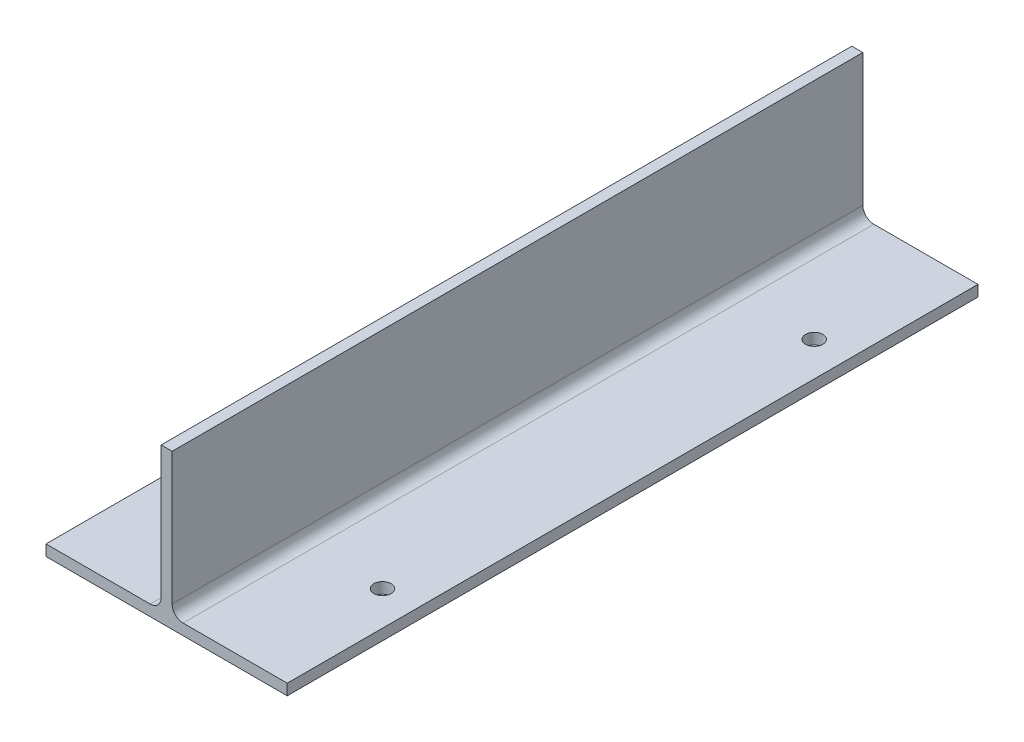
ISO-10303-21;
HEADER;
FILE_DESCRIPTION(('STEP AP214'),'2;1');
FILE_NAME('part.step','',(''),(''),'','','');
FILE_SCHEMA(('AUTOMOTIVE_DESIGN { 1 0 10303 214 1 1 1 1 }'));
ENDSEC;
DATA;
#1=APPLICATION_CONTEXT('core data for automotive mechanical design processes');
#2=APPLICATION_PROTOCOL_DEFINITION('international standard','automotive_design',2000,#1);
#3=PRODUCT_CONTEXT('',#1,'mechanical');
#4=PRODUCT('Part','Part','',(#3));
#5=PRODUCT_RELATED_PRODUCT_CATEGORY('part','',(#4));
#6=PRODUCT_DEFINITION_FORMATION('','',#4);
#7=PRODUCT_DEFINITION_CONTEXT('part definition',#1,'design');
#8=PRODUCT_DEFINITION('design','',#6,#7);
#9=PRODUCT_DEFINITION_SHAPE('','',#8);
#10=(LENGTH_UNIT() NAMED_UNIT(*) SI_UNIT(.MILLI.,.METRE.));
#11=(NAMED_UNIT(*) PLANE_ANGLE_UNIT() SI_UNIT($,.RADIAN.));
#12=(NAMED_UNIT(*) SI_UNIT($,.STERADIAN.) SOLID_ANGLE_UNIT());
#13=UNCERTAINTY_MEASURE_WITH_UNIT(LENGTH_MEASURE(1.E-05),#10,'distance_accuracy_value','');
#14=(GEOMETRIC_REPRESENTATION_CONTEXT(3) GLOBAL_UNCERTAINTY_ASSIGNED_CONTEXT((#13)) GLOBAL_UNIT_ASSIGNED_CONTEXT((#10,
#11,#12)) REPRESENTATION_CONTEXT('',''));
#15=CARTESIAN_POINT('',(0.,0.,0.));
#16=DIRECTION('',(0.,0.,1.));
#17=DIRECTION('',(1.,0.,0.));
#18=AXIS2_PLACEMENT_3D('',#15,#16,#17);
#19=CARTESIAN_POINT('',(3.175,89.3,400.));
#20=DIRECTION('',(0.,-1.,0.));
#21=DIRECTION('',(0.,0.,-1.));
#22=AXIS2_PLACEMENT_3D('',#19,#20,#21);
#23=PLANE('',#22);
#24=DIRECTION('',(-1.,0.,0.));
#25=VECTOR('',#24,1.);
#26=CARTESIAN_POINT('',(3.175,89.3,0.));
#27=LINE('',#26,#25);
#28=CARTESIAN_POINT('',(3.175,89.3,0.));
#29=VERTEX_POINT('',#28);
#30=CARTESIAN_POINT('',(-3.175,89.3,0.));
#31=VERTEX_POINT('',#30);
#32=EDGE_CURVE('E143',#29,#31,#27,.T.);
#33=ORIENTED_EDGE('',*,*,#32,.T.);
#34=DIRECTION('',(0.,0.,-1.));
#35=VECTOR('',#34,1.);
#36=CARTESIAN_POINT('',(-3.175,89.3,400.));
#37=LINE('',#36,#35);
#38=CARTESIAN_POINT('',(-3.175,89.3,400.));
#39=VERTEX_POINT('',#38);
#40=EDGE_CURVE('E11',#39,#31,#37,.T.);
#41=ORIENTED_EDGE('',*,*,#40,.F.);
#42=DIRECTION('',(-1.,0.,0.));
#43=VECTOR('',#42,1.);
#44=CARTESIAN_POINT('',(3.175,89.3,400.));
#45=LINE('',#44,#43);
#46=CARTESIAN_POINT('',(3.175,89.3,400.));
#47=VERTEX_POINT('',#46);
#48=EDGE_CURVE('E162',#47,#39,#45,.T.);
#49=ORIENTED_EDGE('',*,*,#48,.F.);
#50=DIRECTION('',(0.,0.,-1.));
#51=VECTOR('',#50,1.);
#52=CARTESIAN_POINT('',(3.175,89.3,400.));
#53=LINE('',#52,#51);
#54=EDGE_CURVE('E139',#47,#29,#53,.T.);
#55=ORIENTED_EDGE('',*,*,#54,.T.);
#56=EDGE_LOOP('',(#33,#41,#49,#55));
#57=FACE_BOUND('',#56,.T.);
#58=ADVANCED_FACE('F35',(#57),#23,.F.);
#59=CARTESIAN_POINT('',(-3.175,12.7,400.));
#60=DIRECTION('',(1.,0.,0.));
#61=DIRECTION('',(0.,0.,-1.));
#62=AXIS2_PLACEMENT_3D('',#59,#60,#61);
#63=PLANE('',#62);
#64=DIRECTION('',(0.,-1.,0.));
#65=VECTOR('',#64,1.);
#66=CARTESIAN_POINT('',(-3.175,12.7,0.));
#67=LINE('',#66,#65);
#68=CARTESIAN_POINT('',(-3.175,12.7,0.));
#69=VERTEX_POINT('',#68);
#70=EDGE_CURVE('E146',#31,#69,#67,.T.);
#71=ORIENTED_EDGE('',*,*,#70,.T.);
#72=DIRECTION('',(0.,0.,-1.));
#73=VECTOR('',#72,1.);
#74=CARTESIAN_POINT('',(-3.175,12.7,400.));
#75=LINE('',#74,#73);
#76=CARTESIAN_POINT('',(-3.175,12.7,400.));
#77=VERTEX_POINT('',#76);
#78=EDGE_CURVE('E43',#77,#69,#75,.T.);
#79=ORIENTED_EDGE('',*,*,#78,.F.);
#80=DIRECTION('',(0.,-1.,0.));
#81=VECTOR('',#80,1.);
#82=CARTESIAN_POINT('',(-3.175,12.7,400.));
#83=LINE('',#82,#81);
#84=EDGE_CURVE('E100',#39,#77,#83,.T.);
#85=ORIENTED_EDGE('',*,*,#84,.F.);
#86=ORIENTED_EDGE('',*,*,#40,.T.);
#87=EDGE_LOOP('',(#71,#79,#85,#86));
#88=FACE_BOUND('',#87,.T.);
#89=ADVANCED_FACE('F263',(#88),#63,.F.);
#90=CARTESIAN_POINT('',(-9.525,12.7,400.));
#91=DIRECTION('',(0.,0.,-1.));
#92=DIRECTION('',(-1.,0.,0.));
#93=AXIS2_PLACEMENT_3D('',#90,#91,#92);
#94=CYLINDRICAL_SURFACE('',#93,6.35);
#95=CARTESIAN_POINT('',(-9.525,12.7,0.));
#96=DIRECTION('',(0.,0.,-1.));
#97=DIRECTION('',(1.,0.,0.));
#98=AXIS2_PLACEMENT_3D('',#95,#96,#97);
#99=CIRCLE('',#98,6.35);
#100=CARTESIAN_POINT('',(-9.525,6.34999999999999,0.));
#101=VERTEX_POINT('',#100);
#102=EDGE_CURVE('E149',#69,#101,#99,.T.);
#103=ORIENTED_EDGE('',*,*,#102,.T.);
#104=DIRECTION('',(0.,0.,-1.));
#105=VECTOR('',#104,1.);
#106=CARTESIAN_POINT('',(-9.525,6.34999999999999,400.));
#107=LINE('',#106,#105);
#108=CARTESIAN_POINT('',(-9.525,6.34999999999999,400.));
#109=VERTEX_POINT('',#108);
#110=EDGE_CURVE('E175',#109,#101,#107,.T.);
#111=ORIENTED_EDGE('',*,*,#110,.F.);
#112=CARTESIAN_POINT('',(-9.525,12.7,400.));
#113=DIRECTION('',(0.,0.,-1.));
#114=DIRECTION('',(1.,0.,0.));
#115=AXIS2_PLACEMENT_3D('',#112,#113,#114);
#116=CIRCLE('',#115,6.35);
#117=EDGE_CURVE('E183',#77,#109,#116,.T.);
#118=ORIENTED_EDGE('',*,*,#117,.F.);
#119=ORIENTED_EDGE('',*,*,#78,.T.);
#120=EDGE_LOOP('',(#103,#111,#118,#119));
#121=FACE_BOUND('',#120,.T.);
#122=ADVANCED_FACE('F181',(#121),#94,.F.);
#123=CARTESIAN_POINT('',(-69.85,6.35,400.));
#124=DIRECTION('',(0.,-1.,0.));
#125=DIRECTION('',(1.,0.,0.));
#126=AXIS2_PLACEMENT_3D('',#123,#124,#125);
#127=PLANE('',#126);
#128=CARTESIAN_POINT('',(-50.,6.34999999999999,325.));
#129=DIRECTION('',(0.,1.,0.));
#130=DIRECTION('',(1.,0.,0.));
#131=AXIS2_PLACEMENT_3D('',#128,#129,#130);
#132=CIRCLE('',#131,5.00000000000001);
#133=CARTESIAN_POINT('',(-45.,6.34999999999999,325.));
#134=VERTEX_POINT('',#133);
#135=EDGE_CURVE('E227',#134,#134,#132,.T.);
#136=ORIENTED_EDGE('',*,*,#135,.F.);
#137=EDGE_LOOP('',(#136));
#138=FACE_BOUND('',#137,.T.);
#139=CARTESIAN_POINT('',(-50.,6.34999999999999,75.));
#140=DIRECTION('',(0.,1.,0.));
#141=DIRECTION('',(1.,0.,0.));
#142=AXIS2_PLACEMENT_3D('',#139,#140,#141);
#143=CIRCLE('',#142,5.00000000000001);
#144=CARTESIAN_POINT('',(-45.,6.34999999999999,75.));
#145=VERTEX_POINT('',#144);
#146=EDGE_CURVE('E215',#145,#145,#143,.T.);
#147=ORIENTED_EDGE('',*,*,#146,.F.);
#148=EDGE_LOOP('',(#147));
#149=FACE_BOUND('',#148,.T.);
#150=DIRECTION('',(-1.,0.,0.));
#151=VECTOR('',#150,1.);
#152=CARTESIAN_POINT('',(-69.85,6.35,0.));
#153=LINE('',#152,#151);
#154=CARTESIAN_POINT('',(-69.85,6.35,0.));
#155=VERTEX_POINT('',#154);
#156=EDGE_CURVE('E151',#101,#155,#153,.T.);
#157=ORIENTED_EDGE('',*,*,#156,.T.);
#158=DIRECTION('',(0.,0.,-1.));
#159=VECTOR('',#158,1.);
#160=CARTESIAN_POINT('',(-69.85,6.35,400.));
#161=LINE('',#160,#159);
#162=CARTESIAN_POINT('',(-69.85,6.35,400.));
#163=VERTEX_POINT('',#162);
#164=EDGE_CURVE('E172',#163,#155,#161,.T.);
#165=ORIENTED_EDGE('',*,*,#164,.F.);
#166=DIRECTION('',(-1.,0.,0.));
#167=VECTOR('',#166,1.);
#168=CARTESIAN_POINT('',(-69.85,6.35,400.));
#169=LINE('',#168,#167);
#170=EDGE_CURVE('E201',#109,#163,#169,.T.);
#171=ORIENTED_EDGE('',*,*,#170,.F.);
#172=ORIENTED_EDGE('',*,*,#110,.T.);
#173=EDGE_LOOP('',(#157,#165,#171,#172));
#174=FACE_BOUND('',#173,.T.);
#175=ADVANCED_FACE('F192',(#138,#149,#174),#127,.F.);
#176=CARTESIAN_POINT('',(-69.85,0.,400.));
#177=DIRECTION('',(1.,0.,0.));
#178=DIRECTION('',(0.,0.,-1.));
#179=AXIS2_PLACEMENT_3D('',#176,#177,#178);
#180=PLANE('',#179);
#181=DIRECTION('',(0.,-1.,0.));
#182=VECTOR('',#181,1.);
#183=CARTESIAN_POINT('',(-69.85,0.,0.));
#184=LINE('',#183,#182);
#185=CARTESIAN_POINT('',(-69.85,0.,0.));
#186=VERTEX_POINT('',#185);
#187=EDGE_CURVE('E153',#155,#186,#184,.T.);
#188=ORIENTED_EDGE('',*,*,#187,.T.);
#189=DIRECTION('',(0.,0.,-1.));
#190=VECTOR('',#189,1.);
#191=CARTESIAN_POINT('',(-69.85,0.,400.));
#192=LINE('',#191,#190);
#193=CARTESIAN_POINT('',(-69.85,0.,400.));
#194=VERTEX_POINT('',#193);
#195=EDGE_CURVE('E169',#194,#186,#192,.T.);
#196=ORIENTED_EDGE('',*,*,#195,.F.);
#197=DIRECTION('',(0.,-1.,0.));
#198=VECTOR('',#197,1.);
#199=CARTESIAN_POINT('',(-69.85,0.,400.));
#200=LINE('',#199,#198);
#201=EDGE_CURVE('E198',#163,#194,#200,.T.);
#202=ORIENTED_EDGE('',*,*,#201,.F.);
#203=ORIENTED_EDGE('',*,*,#164,.T.);
#204=EDGE_LOOP('',(#188,#196,#202,#203));
#205=FACE_BOUND('',#204,.T.);
#206=ADVANCED_FACE('F196',(#205),#180,.F.);
#207=CARTESIAN_POINT('',(-69.85,0.,400.));
#208=DIRECTION('',(0.,1.,0.));
#209=DIRECTION('',(0.,0.,1.));
#210=AXIS2_PLACEMENT_3D('',#207,#208,#209);
#211=PLANE('',#210);
#212=CARTESIAN_POINT('',(-50.,0.,325.));
#213=DIRECTION('',(0.,1.,0.));
#214=DIRECTION('',(1.,0.,0.));
#215=AXIS2_PLACEMENT_3D('',#212,#213,#214);
#216=CIRCLE('',#215,5.00000000000001);
#217=CARTESIAN_POINT('',(-45.,0.,325.));
#218=VERTEX_POINT('',#217);
#219=EDGE_CURVE('E224',#218,#218,#216,.T.);
#220=ORIENTED_EDGE('',*,*,#219,.T.);
#221=EDGE_LOOP('',(#220));
#222=FACE_BOUND('',#221,.T.);
#223=CARTESIAN_POINT('',(50.,0.,325.));
#224=DIRECTION('',(0.,1.,0.));
#225=DIRECTION('',(-1.,0.,0.));
#226=AXIS2_PLACEMENT_3D('',#223,#224,#225);
#227=CIRCLE('',#226,5.00000000000001);
#228=CARTESIAN_POINT('',(45.,0.,325.));
#229=VERTEX_POINT('',#228);
#230=EDGE_CURVE('E218',#229,#229,#227,.T.);
#231=ORIENTED_EDGE('',*,*,#230,.T.);
#232=EDGE_LOOP('',(#231));
#233=FACE_BOUND('',#232,.T.);
#234=CARTESIAN_POINT('',(-50.,0.,75.));
#235=DIRECTION('',(0.,1.,0.));
#236=DIRECTION('',(1.,0.,0.));
#237=AXIS2_PLACEMENT_3D('',#234,#235,#236);
#238=CIRCLE('',#237,5.00000000000001);
#239=CARTESIAN_POINT('',(-45.,0.,75.));
#240=VERTEX_POINT('',#239);
#241=EDGE_CURVE('E212',#240,#240,#238,.T.);
#242=ORIENTED_EDGE('',*,*,#241,.T.);
#243=EDGE_LOOP('',(#242));
#244=FACE_BOUND('',#243,.T.);
#245=CARTESIAN_POINT('',(50.,0.,75.));
#246=DIRECTION('',(0.,1.,0.));
#247=DIRECTION('',(-1.,0.,0.));
#248=AXIS2_PLACEMENT_3D('',#245,#246,#247);
#249=CIRCLE('',#248,5.00000000000001);
#250=CARTESIAN_POINT('',(45.,0.,75.));
#251=VERTEX_POINT('',#250);
#252=EDGE_CURVE('E147',#251,#251,#249,.T.);
#253=ORIENTED_EDGE('',*,*,#252,.T.);
#254=EDGE_LOOP('',(#253));
#255=FACE_BOUND('',#254,.T.);
#256=DIRECTION('',(1.,0.,0.));
#257=VECTOR('',#256,1.);
#258=CARTESIAN_POINT('',(-69.85,0.,0.));
#259=LINE('',#258,#257);
#260=CARTESIAN_POINT('',(69.85,0.,0.));
#261=VERTEX_POINT('',#260);
#262=EDGE_CURVE('E155',#186,#261,#259,.T.);
#263=ORIENTED_EDGE('',*,*,#262,.T.);
#264=DIRECTION('',(0.,0.,-1.));
#265=VECTOR('',#264,1.);
#266=CARTESIAN_POINT('',(69.85,0.,400.));
#267=LINE('',#266,#265);
#268=CARTESIAN_POINT('',(69.85,0.,400.));
#269=VERTEX_POINT('',#268);
#270=EDGE_CURVE('E166',#269,#261,#267,.T.);
#271=ORIENTED_EDGE('',*,*,#270,.F.);
#272=DIRECTION('',(1.,0.,0.));
#273=VECTOR('',#272,1.);
#274=CARTESIAN_POINT('',(-69.85,0.,400.));
#275=LINE('',#274,#273);
#276=EDGE_CURVE('E200',#194,#269,#275,.T.);
#277=ORIENTED_EDGE('',*,*,#276,.F.);
#278=ORIENTED_EDGE('',*,*,#195,.T.);
#279=EDGE_LOOP('',(#263,#271,#277,#278));
#280=FACE_BOUND('',#279,.T.);
#281=ADVANCED_FACE('F233',(#222,#233,#244,#255,#280),#211,.F.);
#282=CARTESIAN_POINT('',(69.85,0.,400.));
#283=DIRECTION('',(-1.,0.,0.));
#284=DIRECTION('',(0.,0.,1.));
#285=AXIS2_PLACEMENT_3D('',#282,#283,#284);
#286=PLANE('',#285);
#287=DIRECTION('',(0.,1.,0.));
#288=VECTOR('',#287,1.);
#289=CARTESIAN_POINT('',(69.85,0.,0.));
#290=LINE('',#289,#288);
#291=CARTESIAN_POINT('',(69.85,6.35,0.));
#292=VERTEX_POINT('',#291);
#293=EDGE_CURVE('E157',#261,#292,#290,.T.);
#294=ORIENTED_EDGE('',*,*,#293,.T.);
#295=DIRECTION('',(0.,0.,-1.));
#296=VECTOR('',#295,1.);
#297=CARTESIAN_POINT('',(69.85,6.35,400.));
#298=LINE('',#297,#296);
#299=CARTESIAN_POINT('',(69.85,6.35,400.));
#300=VERTEX_POINT('',#299);
#301=EDGE_CURVE('E134',#300,#292,#298,.T.);
#302=ORIENTED_EDGE('',*,*,#301,.F.);
#303=DIRECTION('',(0.,1.,0.));
#304=VECTOR('',#303,1.);
#305=CARTESIAN_POINT('',(69.85,0.,400.));
#306=LINE('',#305,#304);
#307=EDGE_CURVE('E125',#269,#300,#306,.T.);
#308=ORIENTED_EDGE('',*,*,#307,.F.);
#309=ORIENTED_EDGE('',*,*,#270,.T.);
#310=EDGE_LOOP('',(#294,#302,#308,#309));
#311=FACE_BOUND('',#310,.T.);
#312=ADVANCED_FACE('F272',(#311),#286,.F.);
#313=CARTESIAN_POINT('',(69.85,6.35,400.));
#314=DIRECTION('',(0.,-1.,0.));
#315=DIRECTION('',(1.,0.,0.));
#316=AXIS2_PLACEMENT_3D('',#313,#314,#315);
#317=PLANE('',#316);
#318=CARTESIAN_POINT('',(50.,6.34999999999999,325.));
#319=DIRECTION('',(0.,1.,0.));
#320=DIRECTION('',(-1.,0.,0.));
#321=AXIS2_PLACEMENT_3D('',#318,#319,#320);
#322=CIRCLE('',#321,5.00000000000001);
#323=CARTESIAN_POINT('',(45.,6.34999999999999,325.));
#324=VERTEX_POINT('',#323);
#325=EDGE_CURVE('E221',#324,#324,#322,.T.);
#326=ORIENTED_EDGE('',*,*,#325,.F.);
#327=EDGE_LOOP('',(#326));
#328=FACE_BOUND('',#327,.T.);
#329=CARTESIAN_POINT('',(50.,6.34999999999999,75.));
#330=DIRECTION('',(0.,1.,0.));
#331=DIRECTION('',(-1.,0.,0.));
#332=AXIS2_PLACEMENT_3D('',#329,#330,#331);
#333=CIRCLE('',#332,5.00000000000001);
#334=CARTESIAN_POINT('',(45.,6.34999999999999,75.));
#335=VERTEX_POINT('',#334);
#336=EDGE_CURVE('E209',#335,#335,#333,.T.);
#337=ORIENTED_EDGE('',*,*,#336,.F.);
#338=EDGE_LOOP('',(#337));
#339=FACE_BOUND('',#338,.T.);
#340=DIRECTION('',(-1.,0.,0.));
#341=VECTOR('',#340,1.);
#342=CARTESIAN_POINT('',(69.85,6.35,0.));
#343=LINE('',#342,#341);
#344=CARTESIAN_POINT('',(9.525,6.34999999999999,0.));
#345=VERTEX_POINT('',#344);
#346=EDGE_CURVE('E133',#292,#345,#343,.T.);
#347=ORIENTED_EDGE('',*,*,#346,.T.);
#348=DIRECTION('',(0.,0.,-1.));
#349=VECTOR('',#348,1.);
#350=CARTESIAN_POINT('',(9.525,6.34999999999999,400.));
#351=LINE('',#350,#349);
#352=CARTESIAN_POINT('',(9.525,6.34999999999999,400.));
#353=VERTEX_POINT('',#352);
#354=EDGE_CURVE('E130',#353,#345,#351,.T.);
#355=ORIENTED_EDGE('',*,*,#354,.F.);
#356=DIRECTION('',(-1.,0.,0.));
#357=VECTOR('',#356,1.);
#358=CARTESIAN_POINT('',(69.85,6.35,400.));
#359=LINE('',#358,#357);
#360=EDGE_CURVE('E119',#300,#353,#359,.T.);
#361=ORIENTED_EDGE('',*,*,#360,.F.);
#362=ORIENTED_EDGE('',*,*,#301,.T.);
#363=EDGE_LOOP('',(#347,#355,#361,#362));
#364=FACE_BOUND('',#363,.T.);
#365=ADVANCED_FACE('F131',(#328,#339,#364),#317,.F.);
#366=CARTESIAN_POINT('',(9.525,12.7,400.));
#367=DIRECTION('',(0.,0.,-1.));
#368=DIRECTION('',(-1.,0.,0.));
#369=AXIS2_PLACEMENT_3D('',#366,#367,#368);
#370=CYLINDRICAL_SURFACE('',#369,6.35);
#371=CARTESIAN_POINT('',(9.525,12.7,0.));
#372=DIRECTION('',(0.,0.,-1.));
#373=DIRECTION('',(-1.,0.,0.));
#374=AXIS2_PLACEMENT_3D('',#371,#372,#373);
#375=CIRCLE('',#374,6.35);
#376=CARTESIAN_POINT('',(3.175,12.7,0.));
#377=VERTEX_POINT('',#376);
#378=EDGE_CURVE('E86',#345,#377,#375,.T.);
#379=ORIENTED_EDGE('',*,*,#378,.T.);
#380=DIRECTION('',(0.,0.,-1.));
#381=VECTOR('',#380,1.);
#382=CARTESIAN_POINT('',(3.175,12.7,400.));
#383=LINE('',#382,#381);
#384=CARTESIAN_POINT('',(3.175,12.7,400.));
#385=VERTEX_POINT('',#384);
#386=EDGE_CURVE('E135',#385,#377,#383,.T.);
#387=ORIENTED_EDGE('',*,*,#386,.F.);
#388=CARTESIAN_POINT('',(9.525,12.7,400.));
#389=DIRECTION('',(0.,0.,-1.));
#390=DIRECTION('',(-1.,0.,0.));
#391=AXIS2_PLACEMENT_3D('',#388,#389,#390);
#392=CIRCLE('',#391,6.35);
#393=EDGE_CURVE('E123',#353,#385,#392,.T.);
#394=ORIENTED_EDGE('',*,*,#393,.F.);
#395=ORIENTED_EDGE('',*,*,#354,.T.);
#396=EDGE_LOOP('',(#379,#387,#394,#395));
#397=FACE_BOUND('',#396,.T.);
#398=ADVANCED_FACE('F137',(#397),#370,.F.);
#399=CARTESIAN_POINT('',(3.175,12.7,400.));
#400=DIRECTION('',(-1.,0.,0.));
#401=DIRECTION('',(0.,0.,1.));
#402=AXIS2_PLACEMENT_3D('',#399,#400,#401);
#403=PLANE('',#402);
#404=DIRECTION('',(0.,1.,0.));
#405=VECTOR('',#404,1.);
#406=CARTESIAN_POINT('',(3.175,12.7,0.));
#407=LINE('',#406,#405);
#408=EDGE_CURVE('E92',#377,#29,#407,.T.);
#409=ORIENTED_EDGE('',*,*,#408,.T.);
#410=ORIENTED_EDGE('',*,*,#54,.F.);
#411=DIRECTION('',(0.,1.,0.));
#412=VECTOR('',#411,1.);
#413=CARTESIAN_POINT('',(3.175,12.7,400.));
#414=LINE('',#413,#412);
#415=EDGE_CURVE('E51',#385,#47,#414,.T.);
#416=ORIENTED_EDGE('',*,*,#415,.F.);
#417=ORIENTED_EDGE('',*,*,#386,.T.);
#418=EDGE_LOOP('',(#409,#410,#416,#417));
#419=FACE_BOUND('',#418,.T.);
#420=ADVANCED_FACE('F317',(#419),#403,.F.);
#421=CARTESIAN_POINT('',(-9.525,12.7,400.));
#422=DIRECTION('',(0.,0.,1.));
#423=DIRECTION('',(1.,0.,0.));
#424=AXIS2_PLACEMENT_3D('',#421,#422,#423);
#425=PLANE('',#424);
#426=ORIENTED_EDGE('',*,*,#48,.T.);
#427=ORIENTED_EDGE('',*,*,#84,.T.);
#428=ORIENTED_EDGE('',*,*,#117,.T.);
#429=ORIENTED_EDGE('',*,*,#170,.T.);
#430=ORIENTED_EDGE('',*,*,#201,.T.);
#431=ORIENTED_EDGE('',*,*,#276,.T.);
#432=ORIENTED_EDGE('',*,*,#307,.T.);
#433=ORIENTED_EDGE('',*,*,#360,.T.);
#434=ORIENTED_EDGE('',*,*,#393,.T.);
#435=ORIENTED_EDGE('',*,*,#415,.T.);
#436=EDGE_LOOP('',(#426,#427,#428,#429,#430,#431,#432,#433,#434,#435));
#437=FACE_BOUND('',#436,.T.);
#438=ADVANCED_FACE('F121',(#437),#425,.T.);
#439=CARTESIAN_POINT('',(-9.525,12.7,0.));
#440=DIRECTION('',(0.,0.,1.));
#441=DIRECTION('',(1.,0.,0.));
#442=AXIS2_PLACEMENT_3D('',#439,#440,#441);
#443=PLANE('',#442);
#444=ORIENTED_EDGE('',*,*,#32,.F.);
#445=ORIENTED_EDGE('',*,*,#408,.F.);
#446=ORIENTED_EDGE('',*,*,#378,.F.);
#447=ORIENTED_EDGE('',*,*,#346,.F.);
#448=ORIENTED_EDGE('',*,*,#293,.F.);
#449=ORIENTED_EDGE('',*,*,#262,.F.);
#450=ORIENTED_EDGE('',*,*,#187,.F.);
#451=ORIENTED_EDGE('',*,*,#156,.F.);
#452=ORIENTED_EDGE('',*,*,#102,.F.);
#453=ORIENTED_EDGE('',*,*,#70,.F.);
#454=EDGE_LOOP('',(#444,#445,#446,#447,#448,#449,#450,#451,#452,#453));
#455=FACE_BOUND('',#454,.T.);
#456=ADVANCED_FACE('F187',(#455),#443,.F.);
#457=CARTESIAN_POINT('',(50.,0.,75.));
#458=DIRECTION('',(0.,1.,0.));
#459=DIRECTION('',(-1.,0.,0.));
#460=AXIS2_PLACEMENT_3D('',#457,#458,#459);
#461=CYLINDRICAL_SURFACE('',#460,5.00000000000001);
#462=ORIENTED_EDGE('',*,*,#252,.F.);
#463=EDGE_LOOP('',(#462));
#464=FACE_BOUND('',#463,.T.);
#465=ORIENTED_EDGE('',*,*,#336,.T.);
#466=EDGE_LOOP('',(#465));
#467=FACE_BOUND('',#466,.T.);
#468=ADVANCED_FACE('F250',(#464,#467),#461,.F.);
#469=CARTESIAN_POINT('',(-50.,0.,75.));
#470=DIRECTION('',(0.,1.,0.));
#471=DIRECTION('',(-1.,0.,0.));
#472=AXIS2_PLACEMENT_3D('',#469,#470,#471);
#473=CYLINDRICAL_SURFACE('',#472,5.00000000000001);
#474=ORIENTED_EDGE('',*,*,#241,.F.);
#475=EDGE_LOOP('',(#474));
#476=FACE_BOUND('',#475,.T.);
#477=ORIENTED_EDGE('',*,*,#146,.T.);
#478=EDGE_LOOP('',(#477));
#479=FACE_BOUND('',#478,.T.);
#480=ADVANCED_FACE('F248',(#476,#479),#473,.F.);
#481=CARTESIAN_POINT('',(50.,0.,325.));
#482=DIRECTION('',(0.,1.,0.));
#483=DIRECTION('',(-1.,0.,0.));
#484=AXIS2_PLACEMENT_3D('',#481,#482,#483);
#485=CYLINDRICAL_SURFACE('',#484,5.00000000000001);
#486=ORIENTED_EDGE('',*,*,#230,.F.);
#487=EDGE_LOOP('',(#486));
#488=FACE_BOUND('',#487,.T.);
#489=ORIENTED_EDGE('',*,*,#325,.T.);
#490=EDGE_LOOP('',(#489));
#491=FACE_BOUND('',#490,.T.);
#492=ADVANCED_FACE('F239',(#488,#491),#485,.F.);
#493=CARTESIAN_POINT('',(-50.,0.,325.));
#494=DIRECTION('',(0.,1.,0.));
#495=DIRECTION('',(-1.,0.,0.));
#496=AXIS2_PLACEMENT_3D('',#493,#494,#495);
#497=CYLINDRICAL_SURFACE('',#496,5.00000000000001);
#498=ORIENTED_EDGE('',*,*,#219,.F.);
#499=EDGE_LOOP('',(#498));
#500=FACE_BOUND('',#499,.T.);
#501=ORIENTED_EDGE('',*,*,#135,.T.);
#502=EDGE_LOOP('',(#501));
#503=FACE_BOUND('',#502,.T.);
#504=ADVANCED_FACE('F236',(#500,#503),#497,.F.);
#505=CLOSED_SHELL('',(#58,#89,#122,#175,#206,#281,#312,#365,#398,#420,#438,#456,#468,#480,#492,#504));
#506=MANIFOLD_SOLID_BREP('B2',#505);
#507=ADVANCED_BREP_SHAPE_REPRESENTATION('',(#18,#506),#14);
#508=SHAPE_DEFINITION_REPRESENTATION(#9,#507);
ENDSEC;
END-ISO-10303-21;
